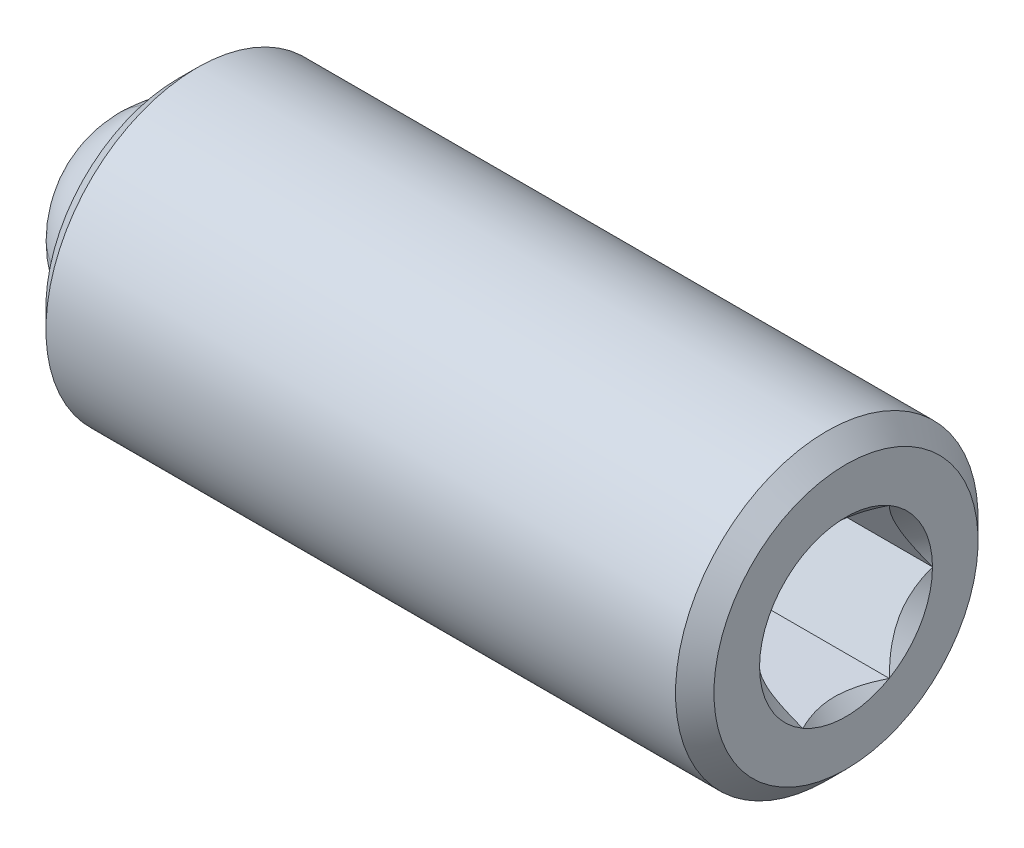
ISO-10303-21;
HEADER;
FILE_DESCRIPTION(('STEP AP214'),'2;1');
FILE_NAME('part.step','',(''),(''),'','','');
FILE_SCHEMA(('AUTOMOTIVE_DESIGN { 1 0 10303 214 1 1 1 1 }'));
ENDSEC;
DATA;
#1=APPLICATION_CONTEXT('core data for automotive mechanical design processes');
#2=APPLICATION_PROTOCOL_DEFINITION('international standard','automotive_design',2000,#1);
#3=PRODUCT_CONTEXT('',#1,'mechanical');
#4=PRODUCT('Part','Part','',(#3));
#5=PRODUCT_RELATED_PRODUCT_CATEGORY('part','',(#4));
#6=PRODUCT_DEFINITION_FORMATION('','',#4);
#7=PRODUCT_DEFINITION_CONTEXT('part definition',#1,'design');
#8=PRODUCT_DEFINITION('design','',#6,#7);
#9=PRODUCT_DEFINITION_SHAPE('','',#8);
#10=(LENGTH_UNIT() NAMED_UNIT(*) SI_UNIT(.MILLI.,.METRE.));
#11=(NAMED_UNIT(*) PLANE_ANGLE_UNIT() SI_UNIT($,.RADIAN.));
#12=(NAMED_UNIT(*) SI_UNIT($,.STERADIAN.) SOLID_ANGLE_UNIT());
#13=UNCERTAINTY_MEASURE_WITH_UNIT(LENGTH_MEASURE(1.E-05),#10,'distance_accuracy_value','');
#14=(GEOMETRIC_REPRESENTATION_CONTEXT(3) GLOBAL_UNCERTAINTY_ASSIGNED_CONTEXT((#13)) GLOBAL_UNIT_ASSIGNED_CONTEXT((#10,
#11,#12)) REPRESENTATION_CONTEXT('',''));
#15=CARTESIAN_POINT('',(0.,0.,0.));
#16=DIRECTION('',(0.,0.,1.));
#17=DIRECTION('',(1.,0.,0.));
#18=AXIS2_PLACEMENT_3D('',#15,#16,#17);
#19=CARTESIAN_POINT('',(-49.5388925463941,7.80634505997568,21.5292838880146));
#20=DIRECTION('',(1.,0.,0.));
#21=DIRECTION('',(0.,0.,-1.));
#22=AXIS2_PLACEMENT_3D('',#19,#20,#21);
#23=PLANE('',#22);
#24=CARTESIAN_POINT('',(-49.5388925463941,7.80634505997568,21.5292838880146));
#25=DIRECTION('',(1.,0.,0.));
#26=DIRECTION('',(0.,0.,-1.));
#27=AXIS2_PLACEMENT_3D('',#24,#25,#26);
#28=CIRCLE('',#27,0.99694999999999);
#29=CARTESIAN_POINT('',(-49.5388925463941,8.39893692435799,20.7275706071168));
#30=VERTEX_POINT('',#29);
#31=CARTESIAN_POINT('',(-49.5388925463941,8.79694505997568,21.4169409198324));
#32=VERTEX_POINT('',#31);
#33=EDGE_CURVE('P0_E11',#30,#32,#28,.T.);
#34=ORIENTED_EDGE('',*,*,#33,.F.);
#35=DIRECTION('',(0.,0.866025403784439,0.5));
#36=VECTOR('',#35,1.);
#37=CARTESIAN_POINT('',(-49.5388925463941,7.80634505997568,20.3854375346961));
#38=LINE('',#37,#36);
#39=CARTESIAN_POINT('',(-49.5388925463941,8.79694505997568,20.9573607113553));
#40=VERTEX_POINT('',#39);
#41=EDGE_CURVE('P0_E247',#30,#40,#38,.T.);
#42=ORIENTED_EDGE('',*,*,#41,.T.);
#43=DIRECTION('',(0.,0.,1.));
#44=VECTOR('',#43,1.);
#45=CARTESIAN_POINT('',(-49.5388925463941,8.79694505997568,20.9573607113553));
#46=LINE('',#45,#44);
#47=EDGE_CURVE('P0_E254',#40,#32,#46,.T.);
#48=ORIENTED_EDGE('',*,*,#47,.T.);
#49=EDGE_LOOP('',(#34,#42,#48));
#50=FACE_BOUND('',#49,.T.);
#51=ADVANCED_FACE('P0_F17',(#50),#23,.T.);
#52=CARTESIAN_POINT('',(-49.5388925463941,8.79694505997568,21.6416268561967));
#53=VERTEX_POINT('',#52);
#54=CARTESIAN_POINT('',(-49.5388925463941,8.39893692435799,22.3309971689123));
#55=VERTEX_POINT('',#54);
#56=EDGE_CURVE('P0_E32',#53,#55,#28,.T.);
#57=ORIENTED_EDGE('',*,*,#56,.F.);
#58=CARTESIAN_POINT('',(-49.5388925463941,8.79694505997568,22.1012070646738));
#59=VERTEX_POINT('',#58);
#60=EDGE_CURVE('P0_E252',#53,#59,#46,.T.);
#61=ORIENTED_EDGE('',*,*,#60,.T.);
#62=DIRECTION('',(0.,-0.866025403784439,0.5));
#63=VECTOR('',#62,1.);
#64=CARTESIAN_POINT('',(-49.5388925463941,8.79694505997568,22.1012070646738));
#65=LINE('',#64,#63);
#66=EDGE_CURVE('P0_E228',#59,#55,#65,.T.);
#67=ORIENTED_EDGE('',*,*,#66,.T.);
#68=EDGE_LOOP('',(#57,#61,#67));
#69=FACE_BOUND('',#68,.T.);
#70=ADVANCED_FACE('P0_F346',(#69),#23,.T.);
#71=CARTESIAN_POINT('',(-49.5388925463941,8.20435319559337,22.4433401370945));
#72=VERTEX_POINT('',#71);
#73=CARTESIAN_POINT('',(-49.5388925463941,7.40833692435797,22.4433401370945));
#74=VERTEX_POINT('',#73);
#75=EDGE_CURVE('P0_E327',#72,#74,#28,.T.);
#76=ORIENTED_EDGE('',*,*,#75,.F.);
#77=CARTESIAN_POINT('',(-49.5388925463941,7.80634505997568,22.673130241333));
#78=VERTEX_POINT('',#77);
#79=EDGE_CURVE('P0_E233',#72,#78,#65,.T.);
#80=ORIENTED_EDGE('',*,*,#79,.T.);
#81=DIRECTION('',(0.,-0.866025403784439,-0.5));
#82=VECTOR('',#81,1.);
#83=CARTESIAN_POINT('',(-49.5388925463941,7.80634505997568,22.673130241333));
#84=LINE('',#83,#82);
#85=EDGE_CURVE('P0_E234',#78,#74,#84,.T.);
#86=ORIENTED_EDGE('',*,*,#85,.T.);
#87=EDGE_LOOP('',(#76,#80,#86));
#88=FACE_BOUND('',#87,.T.);
#89=ADVANCED_FACE('P0_F393',(#88),#23,.T.);
#90=CARTESIAN_POINT('',(-49.5388925463941,7.21375319559338,22.3309971689123));
#91=VERTEX_POINT('',#90);
#92=CARTESIAN_POINT('',(-49.5388925463941,6.81574505997568,21.6416268561967));
#93=VERTEX_POINT('',#92);
#94=EDGE_CURVE('P0_E322',#91,#93,#28,.T.);
#95=ORIENTED_EDGE('',*,*,#94,.F.);
#96=CARTESIAN_POINT('',(-49.5388925463941,6.81574505997568,22.1012070646738));
#97=VERTEX_POINT('',#96);
#98=EDGE_CURVE('P0_E231',#91,#97,#84,.T.);
#99=ORIENTED_EDGE('',*,*,#98,.T.);
#100=DIRECTION('',(0.,0.,-1.));
#101=VECTOR('',#100,1.);
#102=CARTESIAN_POINT('',(-49.5388925463941,6.81574505997568,22.1012070646738));
#103=LINE('',#102,#101);
#104=EDGE_CURVE('P0_E239',#97,#93,#103,.T.);
#105=ORIENTED_EDGE('',*,*,#104,.T.);
#106=EDGE_LOOP('',(#95,#99,#105));
#107=FACE_BOUND('',#106,.T.);
#108=ADVANCED_FACE('P0_F404',(#107),#23,.T.);
#109=CARTESIAN_POINT('',(-49.5388925463941,6.81574505997568,21.4169409198324));
#110=VERTEX_POINT('',#109);
#111=CARTESIAN_POINT('',(-49.5388925463941,7.21375319559338,20.7275706071168));
#112=VERTEX_POINT('',#111);
#113=EDGE_CURVE('P0_E319',#110,#112,#28,.T.);
#114=ORIENTED_EDGE('',*,*,#113,.F.);
#115=CARTESIAN_POINT('',(-49.5388925463941,6.81574505997568,20.9573607113553));
#116=VERTEX_POINT('',#115);
#117=EDGE_CURVE('P0_E237',#110,#116,#103,.T.);
#118=ORIENTED_EDGE('',*,*,#117,.T.);
#119=DIRECTION('',(0.,0.866025403784439,-0.5));
#120=VECTOR('',#119,1.);
#121=CARTESIAN_POINT('',(-49.5388925463941,6.81574505997568,20.9573607113553));
#122=LINE('',#121,#120);
#123=EDGE_CURVE('P0_E244',#116,#112,#122,.T.);
#124=ORIENTED_EDGE('',*,*,#123,.T.);
#125=EDGE_LOOP('',(#114,#118,#124));
#126=FACE_BOUND('',#125,.T.);
#127=ADVANCED_FACE('P0_F397',(#126),#23,.T.);
#128=CARTESIAN_POINT('',(-55.3224925463941,9.20334505997568,21.5292838880146));
#129=DIRECTION('',(1.,0.,0.));
#130=DIRECTION('',(0.,1.,0.));
#131=AXIS2_PLACEMENT_3D('',#128,#129,#130);
#132=PLANE('',#131);
#133=CARTESIAN_POINT('',(-55.3224925463941,7.80634505997569,21.5292838880146));
#134=DIRECTION('',(1.,0.,0.));
#135=DIRECTION('',(0.,1.,0.));
#136=AXIS2_PLACEMENT_3D('',#133,#134,#135);
#137=CIRCLE('',#136,1.74599999999999);
#138=CARTESIAN_POINT('',(-55.3224925463941,9.55234505997567,21.5292838880146));
#139=VERTEX_POINT('',#138);
#140=EDGE_CURVE('P0_E313',#139,#139,#137,.F.);
#141=ORIENTED_EDGE('',*,*,#140,.T.);
#142=EDGE_LOOP('',(#141));
#143=FACE_BOUND('',#142,.T.);
#144=CARTESIAN_POINT('',(-55.3224925463941,7.80634505997569,21.5292838880146));
#145=DIRECTION('',(-1.,0.,0.));
#146=DIRECTION('',(0.,-1.,0.));
#147=AXIS2_PLACEMENT_3D('',#144,#145,#146);
#148=CIRCLE('',#147,1.39699999999999);
#149=CARTESIAN_POINT('',(-55.3224925463941,6.40934505997569,21.5292838880146));
#150=VERTEX_POINT('',#149);
#151=EDGE_CURVE('P0_E302',#150,#150,#148,.T.);
#152=ORIENTED_EDGE('',*,*,#151,.F.);
#153=EDGE_LOOP('',(#152));
#154=FACE_BOUND('',#153,.T.);
#155=ADVANCED_FACE('P0_F403',(#143,#154),#132,.F.);
#156=CARTESIAN_POINT('',(-53.1373990199102,7.80634505997569,21.5292838880146));
#157=DIRECTION('',(-1.,0.,0.));
#158=DIRECTION('',(0.,-1.,0.));
#159=AXIS2_PLACEMENT_3D('',#156,#157,#158);
#160=CYLINDRICAL_SURFACE('',#159,1.39699999999999);
#161=CARTESIAN_POINT('',(-54.5343990199102,7.80634505997569,21.5292838880146));
#162=DIRECTION('',(-1.,0.,0.));
#163=DIRECTION('',(0.,-1.,0.));
#164=AXIS2_PLACEMENT_3D('',#161,#162,#163);
#165=CIRCLE('',#164,1.39699999999999);
#166=CARTESIAN_POINT('',(-54.5343990199102,6.40934505997569,21.5292838880146));
#167=VERTEX_POINT('',#166);
#168=EDGE_CURVE('P0_E285',#167,#167,#165,.T.);
#169=ORIENTED_EDGE('',*,*,#168,.F.);
#170=EDGE_LOOP('',(#169));
#171=FACE_BOUND('',#170,.T.);
#172=ORIENTED_EDGE('',*,*,#151,.T.);
#173=EDGE_LOOP('',(#172));
#174=FACE_BOUND('',#173,.T.);
#175=ADVANCED_FACE('P0_F410',(#171,#174),#160,.F.);
#176=CARTESIAN_POINT('',(-54.5343990199102,7.80634505997569,21.5292838880146));
#177=DIRECTION('',(-1.,0.,0.));
#178=DIRECTION('',(0.,-1.,0.));
#179=AXIS2_PLACEMENT_3D('',#176,#177,#178);
#180=CONICAL_SURFACE('',#179,1.39699999999999,0.785398163397448);
#181=CARTESIAN_POINT('',(-53.1373990199102,7.80634505997569,21.5292838880146));
#182=VERTEX_POINT('',#181);
#183=VERTEX_LOOP('',#182);
#184=FACE_BOUND('',#183,.T.);
#185=ORIENTED_EDGE('',*,*,#168,.T.);
#186=EDGE_LOOP('',(#185));
#187=FACE_BOUND('',#186,.T.);
#188=ADVANCED_FACE('P0_F601',(#184,#187),#180,.F.);
#189=CARTESIAN_POINT('',(-46.4908925463941,7.80634505997568,21.5292838880146));
#190=DIRECTION('',(-1.,0.,0.));
#191=DIRECTION('',(0.,-1.,0.));
#192=AXIS2_PLACEMENT_3D('',#189,#190,#191);
#193=PLANE('',#192);
#194=DIRECTION('',(0.,-0.866025403784439,-0.5));
#195=VECTOR('',#194,1.);
#196=CARTESIAN_POINT('',(-46.4908925463941,7.80634505997568,22.673130241333));
#197=LINE('',#196,#195);
#198=CARTESIAN_POINT('',(-46.4908925463941,6.817212618757,22.1020543601313));
#199=VERTEX_POINT('',#198);
#200=CARTESIAN_POINT('',(-46.4908925463941,6.81574505997568,22.1012070646738));
#201=VERTEX_POINT('',#200);
#202=EDGE_CURVE('P0_E262',#199,#201,#197,.T.);
#203=ORIENTED_EDGE('',*,*,#202,.F.);
#204=CARTESIAN_POINT('',(-46.4908925463941,7.80634505997568,21.5292838880146));
#205=DIRECTION('',(1.,0.,0.));
#206=DIRECTION('',(0.,1.,0.));
#207=AXIS2_PLACEMENT_3D('',#204,#205,#206);
#208=CIRCLE('',#207,1.143);
#209=CARTESIAN_POINT('',(-46.4908925463941,7.80487750119436,22.6722829458756));
#210=VERTEX_POINT('',#209);
#211=EDGE_CURVE('P0_E359',#210,#199,#208,.T.);
#212=ORIENTED_EDGE('',*,*,#211,.F.);
#213=CARTESIAN_POINT('',(-46.4908925463941,7.80634505997568,22.673130241333));
#214=VERTEX_POINT('',#213);
#215=EDGE_CURVE('P0_E263',#214,#210,#197,.T.);
#216=ORIENTED_EDGE('',*,*,#215,.F.);
#217=DIRECTION('',(0.,-0.866025403784439,0.5));
#218=VECTOR('',#217,1.);
#219=CARTESIAN_POINT('',(-46.4908925463941,8.79694505997568,22.1012070646738));
#220=LINE('',#219,#218);
#221=CARTESIAN_POINT('',(-46.4908925463941,7.80781098692445,22.6722838880146));
#222=VERTEX_POINT('',#221);
#223=EDGE_CURVE('P0_E221',#222,#214,#220,.T.);
#224=ORIENTED_EDGE('',*,*,#223,.F.);
#225=CARTESIAN_POINT('',(-46.4908925463941,8.79547750119436,22.1020543601313));
#226=VERTEX_POINT('',#225);
#227=EDGE_CURVE('P0_E48',#226,#222,#208,.T.);
#228=ORIENTED_EDGE('',*,*,#227,.F.);
#229=CARTESIAN_POINT('',(-46.4908925463941,8.79694505997568,22.1012070646738));
#230=VERTEX_POINT('',#229);
#231=EDGE_CURVE('P0_E259',#230,#226,#220,.T.);
#232=ORIENTED_EDGE('',*,*,#231,.F.);
#233=DIRECTION('',(0.,0.,1.));
#234=VECTOR('',#233,1.);
#235=CARTESIAN_POINT('',(-46.4908925463941,8.79694505997568,20.9573607113553));
#236=LINE('',#235,#234);
#237=CARTESIAN_POINT('',(-46.4908925463941,8.79694505997568,22.0995124737589));
#238=VERTEX_POINT('',#237);
#239=EDGE_CURVE('P0_E278',#238,#230,#236,.T.);
#240=ORIENTED_EDGE('',*,*,#239,.F.);
#241=CARTESIAN_POINT('',(-46.4908925463941,8.79694505997568,20.9590553022702));
#242=VERTEX_POINT('',#241);
#243=EDGE_CURVE('P0_E165',#242,#238,#208,.T.);
#244=ORIENTED_EDGE('',*,*,#243,.F.);
#245=CARTESIAN_POINT('',(-46.4908925463941,8.79694505997568,20.9573607113553));
#246=VERTEX_POINT('',#245);
#247=EDGE_CURVE('P0_E279',#246,#242,#236,.T.);
#248=ORIENTED_EDGE('',*,*,#247,.F.);
#249=DIRECTION('',(0.,0.866025403784439,0.5));
#250=VECTOR('',#249,1.);
#251=CARTESIAN_POINT('',(-46.4908925463941,7.80634505997568,20.3854375346961));
#252=LINE('',#251,#250);
#253=CARTESIAN_POINT('',(-46.4908925463941,8.79547750119436,20.9565134158979));
#254=VERTEX_POINT('',#253);
#255=EDGE_CURVE('P0_E274',#254,#246,#252,.T.);
#256=ORIENTED_EDGE('',*,*,#255,.F.);
#257=CARTESIAN_POINT('',(-46.4908925463941,7.807812618757,20.3862848301535));
#258=VERTEX_POINT('',#257);
#259=EDGE_CURVE('P0_E168',#258,#254,#208,.T.);
#260=ORIENTED_EDGE('',*,*,#259,.F.);
#261=CARTESIAN_POINT('',(-46.4908925463941,7.80634505997568,20.3854375346961));
#262=VERTEX_POINT('',#261);
#263=EDGE_CURVE('P0_E275',#262,#258,#252,.T.);
#264=ORIENTED_EDGE('',*,*,#263,.F.);
#265=DIRECTION('',(0.,0.866025403784439,-0.5));
#266=VECTOR('',#265,1.);
#267=CARTESIAN_POINT('',(-46.4908925463941,6.81574505997568,20.9573607113553));
#268=LINE('',#267,#266);
#269=CARTESIAN_POINT('',(-46.4908925463941,7.8048791330269,20.3862838880146));
#270=VERTEX_POINT('',#269);
#271=EDGE_CURVE('P0_E270',#270,#262,#268,.T.);
#272=ORIENTED_EDGE('',*,*,#271,.F.);
#273=CARTESIAN_POINT('',(-46.4908925463941,6.817212618757,20.9565134158979));
#274=VERTEX_POINT('',#273);
#275=EDGE_CURVE('P0_E363',#274,#270,#208,.T.);
#276=ORIENTED_EDGE('',*,*,#275,.F.);
#277=CARTESIAN_POINT('',(-46.4908925463941,6.81574505997568,20.9573607113553));
#278=VERTEX_POINT('',#277);
#279=EDGE_CURVE('P0_E271',#278,#274,#268,.T.);
#280=ORIENTED_EDGE('',*,*,#279,.F.);
#281=DIRECTION('',(0.,0.,-1.));
#282=VECTOR('',#281,1.);
#283=CARTESIAN_POINT('',(-46.4908925463941,6.81574505997568,22.1012070646738));
#284=LINE('',#283,#282);
#285=CARTESIAN_POINT('',(-46.4908925463941,6.81574505997568,20.9590553022702));
#286=VERTEX_POINT('',#285);
#287=EDGE_CURVE('P0_E266',#286,#278,#284,.T.);
#288=ORIENTED_EDGE('',*,*,#287,.F.);
#289=CARTESIAN_POINT('',(-46.4908925463941,6.81574505997568,22.0995124737589));
#290=VERTEX_POINT('',#289);
#291=EDGE_CURVE('P0_E360',#290,#286,#208,.T.);
#292=ORIENTED_EDGE('',*,*,#291,.F.);
#293=EDGE_CURVE('P0_E267',#201,#290,#284,.T.);
#294=ORIENTED_EDGE('',*,*,#293,.F.);
#295=EDGE_LOOP('',(#203,#212,#216,#224,#228,#232,#240,#244,#248,#256,#260,#264,#272,#276,#280,
#288,#292,#294));
#296=FACE_BOUND('',#295,.T.);
#297=CARTESIAN_POINT('',(-46.4908925463941,7.80634505997568,21.5292838880146));
#298=DIRECTION('',(-1.,0.,0.));
#299=DIRECTION('',(0.,-1.,0.));
#300=AXIS2_PLACEMENT_3D('',#297,#298,#299);
#301=CIRCLE('',#300,1.746);
#302=CARTESIAN_POINT('',(-46.4908925463941,6.06034505997568,21.5292838880146));
#303=VERTEX_POINT('',#302);
#304=EDGE_CURVE('P0_E311',#303,#303,#301,.F.);
#305=ORIENTED_EDGE('',*,*,#304,.T.);
#306=EDGE_LOOP('',(#305));
#307=FACE_BOUND('',#306,.T.);
#308=ADVANCED_FACE('P0_F354',(#296,#307),#193,.F.);
#309=CARTESIAN_POINT('',(-53.1373990199102,7.80634505997569,21.5292838880146));
#310=DIRECTION('',(-1.,0.,0.));
#311=DIRECTION('',(0.,-1.,0.));
#312=AXIS2_PLACEMENT_3D('',#309,#310,#311);
#313=CYLINDRICAL_SURFACE('',#312,2.);
#314=CARTESIAN_POINT('',(-46.7448925463941,7.80634505997568,21.5292838880146));
#315=DIRECTION('',(-1.,0.,0.));
#316=DIRECTION('',(0.,-1.,0.));
#317=AXIS2_PLACEMENT_3D('',#314,#315,#316);
#318=CIRCLE('',#317,2.);
#319=CARTESIAN_POINT('',(-46.7448925463941,5.80634505997568,21.5292838880146));
#320=VERTEX_POINT('',#319);
#321=EDGE_CURVE('P0_E308',#320,#320,#318,.T.);
#322=ORIENTED_EDGE('',*,*,#321,.T.);
#323=EDGE_LOOP('',(#322));
#324=FACE_BOUND('',#323,.T.);
#325=CARTESIAN_POINT('',(-55.0684925463941,7.80634505997569,21.5292838880146));
#326=DIRECTION('',(1.,0.,0.));
#327=DIRECTION('',(0.,1.,0.));
#328=AXIS2_PLACEMENT_3D('',#325,#326,#327);
#329=CIRCLE('',#328,2.);
#330=CARTESIAN_POINT('',(-55.0684925463941,9.80634505997568,21.5292838880146));
#331=VERTEX_POINT('',#330);
#332=EDGE_CURVE('P0_E305',#331,#331,#329,.T.);
#333=ORIENTED_EDGE('',*,*,#332,.T.);
#334=EDGE_LOOP('',(#333));
#335=FACE_BOUND('',#334,.T.);
#336=ADVANCED_FACE('P0_F211',(#324,#335),#313,.T.);
#337=CARTESIAN_POINT('',(-46.7448925463941,7.80634505997568,21.5292838880146));
#338=DIRECTION('',(-1.,0.,0.));
#339=DIRECTION('',(0.,-1.,0.));
#340=AXIS2_PLACEMENT_3D('',#337,#338,#339);
#341=CONICAL_SURFACE('',#340,2.,0.785398163397446);
#342=ORIENTED_EDGE('',*,*,#304,.F.);
#343=EDGE_LOOP('',(#342));
#344=FACE_BOUND('',#343,.T.);
#345=ORIENTED_EDGE('',*,*,#321,.F.);
#346=EDGE_LOOP('',(#345));
#347=FACE_BOUND('',#346,.T.);
#348=ADVANCED_FACE('P0_F574',(#344,#347),#341,.T.);
#349=CARTESIAN_POINT('',(-55.3224925463941,7.80634505997569,21.5292838880146));
#350=DIRECTION('',(1.,0.,0.));
#351=DIRECTION('',(0.,1.,0.));
#352=AXIS2_PLACEMENT_3D('',#349,#350,#351);
#353=CONICAL_SURFACE('',#352,1.74599999999999,0.785398163397448);
#354=ORIENTED_EDGE('',*,*,#332,.F.);
#355=EDGE_LOOP('',(#354));
#356=FACE_BOUND('',#355,.T.);
#357=ORIENTED_EDGE('',*,*,#140,.F.);
#358=EDGE_LOOP('',(#357));
#359=FACE_BOUND('',#358,.T.);
#360=ADVANCED_FACE('P0_F19',(#356,#359),#353,.T.);
#361=CARTESIAN_POINT('',(-49.5388925463941,8.79694505997568,22.1012070646738));
#362=DIRECTION('',(0.,0.5,0.866025403784439));
#363=DIRECTION('',(0.,-0.866025403784439,0.5));
#364=AXIS2_PLACEMENT_3D('',#361,#362,#363);
#365=PLANE('',#364);
#366=ORIENTED_EDGE('',*,*,#231,.T.);
#367=CARTESIAN_POINT('',(-46.4906925463939,8.7958245921301,22.1018539670861));
#368=CARTESIAN_POINT('',(-46.5102590050146,8.76184453992799,22.121472359372));
#369=CARTESIAN_POINT('',(-46.5286731602873,8.72729709355357,22.1414183368361));
#370=CARTESIAN_POINT('',(-46.5623832654716,8.65685525137214,22.1820879533818));
#371=CARTESIAN_POINT('',(-46.5776605586903,8.62095421917391,22.2028154239856));
#372=CARTESIAN_POINT('',(-46.6038273998988,8.54856214433129,22.2446110078832));
#373=CARTESIAN_POINT('',(-46.6147824300038,8.51208937274734,22.2656685723753));
#374=CARTESIAN_POINT('',(-46.6316585069572,8.43834495297953,22.3082449329795));
#375=CARTESIAN_POINT('',(-46.6375920692112,8.40107552972844,22.329762444526));
#376=CARTESIAN_POINT('',(-46.6429459349502,8.33678082232183,22.3668830111547));
#377=CARTESIAN_POINT('',(-46.6437333550918,8.30983814983403,22.3824383703682));
#378=CARTESIAN_POINT('',(-46.6423799493829,8.25600563015096,22.4135185900984));
#379=CARTESIAN_POINT('',(-46.6402384721228,8.22911579603952,22.4290434430611));
#380=CARTESIAN_POINT('',(-46.6295625381593,8.14883163348696,22.4753955259225));
#381=CARTESIAN_POINT('',(-46.6167754251208,8.09583758028656,22.5059916568032));
#382=CARTESIAN_POINT('',(-46.5860142537032,8.00308848437012,22.5595403722976));
#383=CARTESIAN_POINT('',(-46.5696903140842,7.9628876840985,22.5827503151561));
#384=CARTESIAN_POINT('',(-46.5329370572282,7.88405195284486,22.6282661458171));
#385=CARTESIAN_POINT('',(-46.5125211395954,7.8454123931566,22.6505747060045));
#386=CARTESIAN_POINT('',(-46.4906925463941,7.80746552782162,22.6724833389206));
#387=B_SPLINE_CURVE_WITH_KNOTS('',3,(#367,#368,#369,#370,#371,#372,#373,#374,#375,#376,#377,
#378,#379,#380,#381,#382,#383,#384,#385,#386),.UNSPECIFIED.,.F.,.F.,(4,2,2,2,2,2,2,2,2,4),(0.,
0.131625127619597,0.264011770716204,0.394307736662356,0.524277991049731,0.617504646941289,
0.71075204054236,0.897297861024571,1.04472299547961,1.19167303462289),.UNSPECIFIED.);
#388=EDGE_CURVE('P0_E214',#226,#222,#387,.T.);
#389=ORIENTED_EDGE('',*,*,#388,.T.);
#390=ORIENTED_EDGE('',*,*,#223,.T.);
#391=DIRECTION('',(1.,0.,0.));
#392=VECTOR('',#391,1.);
#393=CARTESIAN_POINT('',(-49.5388925463941,7.80634505997568,22.673130241333));
#394=LINE('',#393,#392);
#395=EDGE_CURVE('P0_E257',#78,#214,#394,.T.);
#396=ORIENTED_EDGE('',*,*,#395,.F.);
#397=ORIENTED_EDGE('',*,*,#79,.F.);
#398=EDGE_CURVE('P0_E232',#55,#72,#65,.T.);
#399=ORIENTED_EDGE('',*,*,#398,.F.);
#400=ORIENTED_EDGE('',*,*,#66,.F.);
#401=DIRECTION('',(1.,0.,0.));
#402=VECTOR('',#401,1.);
#403=CARTESIAN_POINT('',(-49.5388925463941,8.79694505997568,22.1012070646738));
#404=LINE('',#403,#402);
#405=EDGE_CURVE('P0_E282',#59,#230,#404,.T.);
#406=ORIENTED_EDGE('',*,*,#405,.T.);
#407=EDGE_LOOP('',(#366,#389,#390,#396,#397,#399,#400,#406));
#408=FACE_BOUND('',#407,.T.);
#409=ADVANCED_FACE('P0_F205',(#408),#365,.F.);
#410=CARTESIAN_POINT('',(-49.5388925463941,8.79694505997568,20.9573607113553));
#411=DIRECTION('',(0.,1.,0.));
#412=DIRECTION('',(0.,0.,1.));
#413=AXIS2_PLACEMENT_3D('',#410,#411,#412);
#414=PLANE('',#413);
#415=ORIENTED_EDGE('',*,*,#247,.T.);
#416=CARTESIAN_POINT('',(-46.1235823296184,8.79694505997568,20.3892187184312));
#417=CARTESIAN_POINT('',(-46.1445357886817,8.79694505997568,20.4169812050963));
#418=CARTESIAN_POINT('',(-46.1652836255819,8.79694505997568,20.4448984469341));
#419=CARTESIAN_POINT('',(-46.2062831353135,8.79694505997568,20.5011052028504));
#420=CARTESIAN_POINT('',(-46.2265346830941,8.79694505997568,20.5293948080489));
#421=CARTESIAN_POINT('',(-46.2867064860434,8.79694505997568,20.6153305043684));
#422=CARTESIAN_POINT('',(-46.3257211713851,8.79694505997568,20.6736213639959));
#423=CARTESIAN_POINT('',(-46.4023063203306,8.79694505997568,20.7958512666058));
#424=CARTESIAN_POINT('',(-46.439667643137,8.79694505997568,20.8599228586336));
#425=CARTESIAN_POINT('',(-46.5080057402334,8.79694505997568,20.9912655384185));
#426=CARTESIAN_POINT('',(-46.5390040370871,8.79694505997568,21.0585248606222));
#427=CARTESIAN_POINT('',(-46.5769274034828,8.79694505997568,21.1594872862629));
#428=CARTESIAN_POINT('',(-46.5878126567894,8.79694505997568,21.1916968672462));
#429=CARTESIAN_POINT('',(-46.6069971972716,8.79694505997568,21.2568931213354));
#430=CARTESIAN_POINT('',(-46.6152963061343,8.79694505997568,21.2898798478564));
#431=CARTESIAN_POINT('',(-46.6287383524986,8.79694505997568,21.3558770985005));
#432=CARTESIAN_POINT('',(-46.6339357861337,8.79694505997568,21.3888763474111));
#433=CARTESIAN_POINT('',(-46.6410764234897,8.79694505997568,21.4552378820543));
#434=CARTESIAN_POINT('',(-46.6430191295743,8.79694505997568,21.4886002225175));
#435=CARTESIAN_POINT('',(-46.6435031289214,8.79694505997568,21.5541434185273));
#436=CARTESIAN_POINT('',(-46.6421647360608,8.79694505997568,21.5863234269759));
#437=CARTESIAN_POINT('',(-46.6364266161165,8.79694505997568,21.650396804902));
#438=CARTESIAN_POINT('',(-46.6320275924625,8.79694505997568,21.6822902385379));
#439=CARTESIAN_POINT('',(-46.6203336681522,8.79694505997568,21.7461155097927));
#440=CARTESIAN_POINT('',(-46.612989051085,8.79694505997568,21.7780380998047));
#441=CARTESIAN_POINT('',(-46.595794150066,8.79694505997568,21.8411858546559));
#442=CARTESIAN_POINT('',(-46.5859440764946,8.79694505997568,21.8724110778128));
#443=CARTESIAN_POINT('',(-46.5512190503309,8.79694505997568,21.9707469163157));
#444=CARTESIAN_POINT('',(-46.5223882166657,8.79694505997568,22.0364571965356));
#445=CARTESIAN_POINT('',(-46.4582871381036,8.79694505997568,22.1647905917929));
#446=CARTESIAN_POINT('',(-46.4229937529597,8.79694505997568,22.2274015515155));
#447=CARTESIAN_POINT('',(-46.3501812204873,8.79694505997568,22.3470597187596));
#448=CARTESIAN_POINT('',(-46.3128598640196,8.79694505997568,22.4042287909065));
#449=CARTESIAN_POINT('',(-46.2551652602994,8.79694505997568,22.4884559262912));
#450=CARTESIAN_POINT('',(-46.2357303647779,8.79694505997568,22.5161681094821));
#451=CARTESIAN_POINT('',(-46.19634665217,8.79694505997568,22.5712138159907));
#452=CARTESIAN_POINT('',(-46.1763979770725,8.79694505997568,22.5985474407836));
#453=CARTESIAN_POINT('',(-46.1562362734382,8.79694505997568,22.6257234444908));
#454=B_SPLINE_CURVE_WITH_KNOTS('',3,(#416,#417,#418,#419,#420,#421,#422,#423,#424,#425,#426,
#427,#428,#429,#430,#431,#432,#433,#434,#435,#436,#437,#438,#439,#440,#441,#442,#443,#444,#445,
#446,#447,#448,#449,#450,#451,#452,#453),.UNSPECIFIED.,.F.,.F.,(4,2,2,2,2,2,2,2,2,2,2,2,2,2,2,2,
2,2,4),(0.,0.104344019556665,0.208714065995305,0.41904723860194,0.641371595426503,
0.862931089855696,0.964842435960924,1.06676080722523,1.16683130424735,1.26691710029625,
1.363388122542,1.45983698002154,1.55798726512869,1.65612931138883,1.87076833826789,
2.08619150382141,2.29090841446406,2.39244822901592,2.49396027677513),.UNSPECIFIED.);
#455=EDGE_CURVE('P0_E222',#242,#238,#454,.T.);
#456=ORIENTED_EDGE('',*,*,#455,.T.);
#457=ORIENTED_EDGE('',*,*,#239,.T.);
#458=ORIENTED_EDGE('',*,*,#405,.F.);
#459=ORIENTED_EDGE('',*,*,#60,.F.);
#460=EDGE_CURVE('P0_E258',#32,#53,#46,.T.);
#461=ORIENTED_EDGE('',*,*,#460,.F.);
#462=ORIENTED_EDGE('',*,*,#47,.F.);
#463=DIRECTION('',(1.,0.,0.));
#464=VECTOR('',#463,1.);
#465=CARTESIAN_POINT('',(-49.5388925463941,8.79694505997568,20.9573607113553));
#466=LINE('',#465,#464);
#467=EDGE_CURVE('P0_E286',#40,#246,#466,.T.);
#468=ORIENTED_EDGE('',*,*,#467,.T.);
#469=EDGE_LOOP('',(#415,#456,#457,#458,#459,#461,#462,#468));
#470=FACE_BOUND('',#469,.T.);
#471=ADVANCED_FACE('P0_F209',(#470),#414,.F.);
#472=CARTESIAN_POINT('',(-49.5388925463941,7.80634505997568,20.3854375346961));
#473=DIRECTION('',(0.,0.5,-0.866025403784439));
#474=DIRECTION('',(0.,0.866025403784439,0.5));
#475=AXIS2_PLACEMENT_3D('',#472,#473,#474);
#476=PLANE('',#475);
#477=ORIENTED_EDGE('',*,*,#263,.T.);
#478=CARTESIAN_POINT('',(-46.4906925463941,7.80746552782162,20.3860844371086));
#479=CARTESIAN_POINT('',(-46.5102590050148,7.84144558002371,20.4057028293945));
#480=CARTESIAN_POINT('',(-46.5286731602875,7.87599302639811,20.4256488068586));
#481=CARTESIAN_POINT('',(-46.5623832654717,7.94643486857949,20.4663184234042));
#482=CARTESIAN_POINT('',(-46.5776605586904,7.9823359007777,20.487045894008));
#483=CARTESIAN_POINT('',(-46.6038273998989,8.05472797562027,20.5288414779056));
#484=CARTESIAN_POINT('',(-46.6147824300039,8.09120074720419,20.5498990423977));
#485=CARTESIAN_POINT('',(-46.6316585069572,8.16494516697195,20.5924754030018));
#486=CARTESIAN_POINT('',(-46.6375920692112,8.20221459022301,20.6139929145483));
#487=CARTESIAN_POINT('',(-46.6429459349502,8.26650929762959,20.651113481177));
#488=CARTESIAN_POINT('',(-46.6437333550918,8.29345197011739,20.6666688403905));
#489=CARTESIAN_POINT('',(-46.6423799493829,8.34728448980046,20.6977490601207));
#490=CARTESIAN_POINT('',(-46.6402384721228,8.3741743239119,20.7132739130834));
#491=CARTESIAN_POINT('',(-46.6295625381593,8.45445848646445,20.7596259959448));
#492=CARTESIAN_POINT('',(-46.6167754251208,8.50745253966484,20.7902221268255));
#493=CARTESIAN_POINT('',(-46.5860142537031,8.60020163558135,20.84377084232));
#494=CARTESIAN_POINT('',(-46.5696903140841,8.64040243585302,20.8669807851785));
#495=CARTESIAN_POINT('',(-46.5329370572281,8.71923816710677,20.9124966158396));
#496=CARTESIAN_POINT('',(-46.5125211395952,8.75787772679508,20.934805176027));
#497=CARTESIAN_POINT('',(-46.4906925463939,8.7958245921301,20.9567138089431));
#498=B_SPLINE_CURVE_WITH_KNOTS('',3,(#478,#479,#480,#481,#482,#483,#484,#485,#486,#487,#488,
#489,#490,#491,#492,#493,#494,#495,#496,#497),.UNSPECIFIED.,.F.,.F.,(4,2,2,2,2,2,2,2,2,4),(0.,
0.131625127619501,0.264011770716002,0.394307736662059,0.524277991049336,0.617504646940887,
0.710752040541952,0.897297861024162,1.04472299547941,1.19167303462289),.UNSPECIFIED.);
#499=EDGE_CURVE('P0_E373',#258,#254,#498,.T.);
#500=ORIENTED_EDGE('',*,*,#499,.T.);
#501=ORIENTED_EDGE('',*,*,#255,.T.);
#502=ORIENTED_EDGE('',*,*,#467,.F.);
#503=ORIENTED_EDGE('',*,*,#41,.F.);
#504=CARTESIAN_POINT('',(-49.5388925463941,8.20435319559336,20.6152276389346));
#505=VERTEX_POINT('',#504);
#506=EDGE_CURVE('P0_E253',#505,#30,#38,.T.);
#507=ORIENTED_EDGE('',*,*,#506,.F.);
#508=CARTESIAN_POINT('',(-49.5388925463941,7.80634505997568,20.3854375346961));
#509=VERTEX_POINT('',#508);
#510=EDGE_CURVE('P0_E249',#509,#505,#38,.T.);
#511=ORIENTED_EDGE('',*,*,#510,.F.);
#512=DIRECTION('',(1.,0.,0.));
#513=VECTOR('',#512,1.);
#514=CARTESIAN_POINT('',(-49.5388925463941,7.80634505997568,20.3854375346961));
#515=LINE('',#514,#513);
#516=EDGE_CURVE('P0_E289',#509,#262,#515,.T.);
#517=ORIENTED_EDGE('',*,*,#516,.T.);
#518=EDGE_LOOP('',(#477,#500,#501,#502,#503,#507,#511,#517));
#519=FACE_BOUND('',#518,.T.);
#520=ADVANCED_FACE('P0_F377',(#519),#476,.F.);
#521=CARTESIAN_POINT('',(-49.5388925463941,6.81574505997568,20.9573607113553));
#522=DIRECTION('',(0.,-0.5,-0.866025403784439));
#523=DIRECTION('',(0.,0.866025403784439,-0.5));
#524=AXIS2_PLACEMENT_3D('',#521,#522,#523);
#525=PLANE('',#524);
#526=ORIENTED_EDGE('',*,*,#279,.T.);
#527=CARTESIAN_POINT('',(-46.4906925463939,6.81686552782125,20.9567138089431));
#528=CARTESIAN_POINT('',(-46.5102590050146,6.85084558002336,20.9370954166571));
#529=CARTESIAN_POINT('',(-46.5286731602873,6.88539302639779,20.917149439193));
#530=CARTESIAN_POINT('',(-46.5623832654716,6.95583486857921,20.8764798226473));
#531=CARTESIAN_POINT('',(-46.5776605586903,6.99173590077745,20.8557523520435));
#532=CARTESIAN_POINT('',(-46.6038273998988,7.06412797562006,20.8139567681459));
#533=CARTESIAN_POINT('',(-46.6147824300038,7.10060074720401,20.7928992036538));
#534=CARTESIAN_POINT('',(-46.6316585069572,7.17434516697183,20.7503228430497));
#535=CARTESIAN_POINT('',(-46.6375920692112,7.21161459022292,20.7288053315031));
#536=CARTESIAN_POINT('',(-46.6429459349502,7.27590929762953,20.6916847648744));
#537=CARTESIAN_POINT('',(-46.6437333550918,7.30285197011733,20.6761294056609));
#538=CARTESIAN_POINT('',(-46.6423799493829,7.3566844898004,20.6450491859307));
#539=CARTESIAN_POINT('',(-46.6402384721228,7.38357432391184,20.629524332968));
#540=CARTESIAN_POINT('',(-46.6295625381593,7.46385848646439,20.5831722501066));
#541=CARTESIAN_POINT('',(-46.6167754251208,7.51685253966479,20.5525761192259));
#542=CARTESIAN_POINT('',(-46.5860142537032,7.60960163558124,20.4990274037315));
#543=CARTESIAN_POINT('',(-46.5696903140842,7.64980243585286,20.475817460873));
#544=CARTESIAN_POINT('',(-46.5329370572282,7.72863816710649,20.430301630212));
#545=CARTESIAN_POINT('',(-46.5125211395954,7.76727772679476,20.4079930700246));
#546=CARTESIAN_POINT('',(-46.4906925463941,7.80522459212973,20.3860844371086));
#547=B_SPLINE_CURVE_WITH_KNOTS('',3,(#527,#528,#529,#530,#531,#532,#533,#534,#535,#536,#537,
#538,#539,#540,#541,#542,#543,#544,#545,#546),.UNSPECIFIED.,.F.,.F.,(4,2,2,2,2,2,2,2,2,4),(0.,
0.131625127619597,0.264011770716206,0.394307736662363,0.524277991049735,0.617504646941291,
0.710752040542363,0.897297861024575,1.04472299547961,1.19167303462289),.UNSPECIFIED.);
#548=EDGE_CURVE('P0_E181',#274,#270,#547,.T.);
#549=ORIENTED_EDGE('',*,*,#548,.T.);
#550=ORIENTED_EDGE('',*,*,#271,.T.);
#551=ORIENTED_EDGE('',*,*,#516,.F.);
#552=CARTESIAN_POINT('',(-49.5388925463941,7.40833692435797,20.6152276389346));
#553=VERTEX_POINT('',#552);
#554=EDGE_CURVE('P0_E242',#553,#509,#122,.T.);
#555=ORIENTED_EDGE('',*,*,#554,.F.);
#556=EDGE_CURVE('P0_E248',#112,#553,#122,.T.);
#557=ORIENTED_EDGE('',*,*,#556,.F.);
#558=ORIENTED_EDGE('',*,*,#123,.F.);
#559=DIRECTION('',(1.,0.,0.));
#560=VECTOR('',#559,1.);
#561=CARTESIAN_POINT('',(-49.5388925463941,6.81574505997568,20.9573607113553));
#562=LINE('',#561,#560);
#563=EDGE_CURVE('P0_E292',#116,#278,#562,.T.);
#564=ORIENTED_EDGE('',*,*,#563,.T.);
#565=EDGE_LOOP('',(#526,#549,#550,#551,#555,#557,#558,#564));
#566=FACE_BOUND('',#565,.T.);
#567=ADVANCED_FACE('P0_F196',(#566),#525,.F.);
#568=CARTESIAN_POINT('',(-49.5388925463941,6.81574505997568,22.1012070646738));
#569=DIRECTION('',(0.,-1.,0.));
#570=DIRECTION('',(0.,0.,-1.));
#571=AXIS2_PLACEMENT_3D('',#568,#569,#570);
#572=PLANE('',#571);
#573=ORIENTED_EDGE('',*,*,#293,.T.);
#574=CARTESIAN_POINT('',(-46.1235823294886,6.81574505997568,20.3892187182592));
#575=CARTESIAN_POINT('',(-46.1445357885569,6.81574505997568,20.4169812049291));
#576=CARTESIAN_POINT('',(-46.1652836254621,6.81574505997568,20.4448984467718));
#577=CARTESIAN_POINT('',(-46.2062831352036,6.81574505997568,20.5011052026978));
#578=CARTESIAN_POINT('',(-46.2265346829892,6.81574505997568,20.5293948079013));
#579=CARTESIAN_POINT('',(-46.2867064859534,6.81574505997568,20.6153305042357));
#580=CARTESIAN_POINT('',(-46.3257211713051,6.81574505997568,20.6736213638734));
#581=CARTESIAN_POINT('',(-46.402306320271,6.81574505997568,20.7958512665055));
#582=CARTESIAN_POINT('',(-46.4396676430879,6.81574505997568,20.8599228585453));
#583=CARTESIAN_POINT('',(-46.5080057402037,6.81574505997568,20.9912655383554));
#584=CARTESIAN_POINT('',(-46.5390040370663,6.81574505997568,21.0585248605722));
#585=CARTESIAN_POINT('',(-46.5769274034686,6.81574505997568,21.1594872862227));
#586=CARTESIAN_POINT('',(-46.587812656775,6.81574505997568,21.1916968672019));
#587=CARTESIAN_POINT('',(-46.6069971972574,6.81574505997568,21.2568931212827));
#588=CARTESIAN_POINT('',(-46.6152963061208,6.81574505997568,21.2898798477994));
#589=CARTESIAN_POINT('',(-46.6287383524872,6.81574505997568,21.3558770984352));
#590=CARTESIAN_POINT('',(-46.6339357861238,6.81574505997568,21.3888763473417));
#591=CARTESIAN_POINT('',(-46.6410764234838,6.81574505997568,21.4552378819767));
#592=CARTESIAN_POINT('',(-46.6430191295708,6.81574505997568,21.4886002224359));
#593=CARTESIAN_POINT('',(-46.6435031289235,6.81574505997568,21.5541434184384));
#594=CARTESIAN_POINT('',(-46.642164736066,6.81574505997568,21.5863234268836));
#595=CARTESIAN_POINT('',(-46.6364266161284,6.81574505997568,21.6503968048034));
#596=CARTESIAN_POINT('',(-46.632027592478,6.81574505997568,21.6822902384362));
#597=CARTESIAN_POINT('',(-46.6203336681751,6.81574505997568,21.746115509685));
#598=CARTESIAN_POINT('',(-46.6129890511119,6.81574505997568,21.7780380996941));
#599=CARTESIAN_POINT('',(-46.5957941501009,6.81574505997568,21.8411858545396));
#600=CARTESIAN_POINT('',(-46.5859440765335,6.81574505997568,21.8724110776939));
#601=CARTESIAN_POINT('',(-46.5512190503888,6.81574505997568,21.9707469161709));
#602=CARTESIAN_POINT('',(-46.5223882167411,6.81574505997568,22.0364571963688));
#603=CARTESIAN_POINT('',(-46.4582871382159,6.81574505997568,22.1647905915839));
#604=CARTESIAN_POINT('',(-46.4229937530915,6.81574505997568,22.2274015512862));
#605=CARTESIAN_POINT('',(-46.3501812206562,6.81574505997568,22.347059718494));
#606=CARTESIAN_POINT('',(-46.3128598642061,6.81574505997568,22.4042287906246));
#607=CARTESIAN_POINT('',(-46.2551652605122,6.81574505997568,22.4884559259853));
#608=CARTESIAN_POINT('',(-46.2357303649994,6.81574505997568,22.5161681091682));
#609=CARTESIAN_POINT('',(-46.1963466524089,6.81574505997568,22.5712138156611));
#610=CARTESIAN_POINT('',(-46.1763979773201,6.81574505997568,22.598547440446));
#611=CARTESIAN_POINT('',(-46.1562362736945,6.81574505997568,22.6257234441454));
#612=B_SPLINE_CURVE_WITH_KNOTS('',3,(#574,#575,#576,#577,#578,#579,#580,#581,#582,#583,#584,
#585,#586,#587,#588,#589,#590,#591,#592,#593,#594,#595,#596,#597,#598,#599,#600,#601,#602,#603,
#604,#605,#606,#607,#608,#609,#610,#611),.UNSPECIFIED.,.F.,.F.,(4,2,2,2,2,2,2,2,2,2,2,2,2,2,2,2,
2,2,4),(0.,0.104344019577245,0.208714066036483,0.419047238685063,0.641371595556673,
0.862931090032445,0.964842436125758,1.06676080737816,1.16683130438886,1.26691710042635,
1.36338812266163,1.4598369801307,1.55798726522657,1.65612931147543,1.87076833827348,
2.08619150374547,2.29090841431836,2.3924482288358,2.49396027656062),.UNSPECIFIED.);
#613=EDGE_CURVE('P0_E173',#290,#286,#612,.F.);
#614=ORIENTED_EDGE('',*,*,#613,.T.);
#615=ORIENTED_EDGE('',*,*,#287,.T.);
#616=ORIENTED_EDGE('',*,*,#563,.F.);
#617=ORIENTED_EDGE('',*,*,#117,.F.);
#618=EDGE_CURVE('P0_E243',#93,#110,#103,.T.);
#619=ORIENTED_EDGE('',*,*,#618,.F.);
#620=ORIENTED_EDGE('',*,*,#104,.F.);
#621=DIRECTION('',(1.,0.,0.));
#622=VECTOR('',#621,1.);
#623=CARTESIAN_POINT('',(-49.5388925463941,6.81574505997568,22.1012070646738));
#624=LINE('',#623,#622);
#625=EDGE_CURVE('P0_E295',#97,#201,#624,.T.);
#626=ORIENTED_EDGE('',*,*,#625,.T.);
#627=EDGE_LOOP('',(#573,#614,#615,#616,#617,#619,#620,#626));
#628=FACE_BOUND('',#627,.T.);
#629=ADVANCED_FACE('P0_F192',(#628),#572,.F.);
#630=CARTESIAN_POINT('',(-49.5388925463941,7.80634505997568,22.673130241333));
#631=DIRECTION('',(0.,-0.5,0.866025403784439));
#632=DIRECTION('',(0.,-0.866025403784439,-0.5));
#633=AXIS2_PLACEMENT_3D('',#630,#631,#632);
#634=PLANE('',#633);
#635=ORIENTED_EDGE('',*,*,#215,.T.);
#636=CARTESIAN_POINT('',(-46.4906925463941,7.80522459212973,22.6724833389206));
#637=CARTESIAN_POINT('',(-46.5102590050148,7.77124453992764,22.6528649466346));
#638=CARTESIAN_POINT('',(-46.5286731602875,7.73669709355324,22.6329189691705));
#639=CARTESIAN_POINT('',(-46.5623832654717,7.66625525137186,22.5922493526249));
#640=CARTESIAN_POINT('',(-46.5776605586904,7.63035421917365,22.5715218820211));
#641=CARTESIAN_POINT('',(-46.6038273998989,7.55796214433109,22.5297262981235));
#642=CARTESIAN_POINT('',(-46.6147824300039,7.52148937274716,22.5086687336315));
#643=CARTESIAN_POINT('',(-46.6316585069572,7.4477449529794,22.4660923730273));
#644=CARTESIAN_POINT('',(-46.6375920692112,7.41047552972834,22.4445748614808));
#645=CARTESIAN_POINT('',(-46.6429459349502,7.34618082232176,22.4074542948521));
#646=CARTESIAN_POINT('',(-46.6437333550918,7.31923814983396,22.3918989356386));
#647=CARTESIAN_POINT('',(-46.6423799493829,7.26540563015089,22.3608187159084));
#648=CARTESIAN_POINT('',(-46.6402384721228,7.23851579603946,22.3452938629457));
#649=CARTESIAN_POINT('',(-46.6295625381593,7.15823163348691,22.2989417800843));
#650=CARTESIAN_POINT('',(-46.6167754251208,7.10523758028651,22.2683456492036));
#651=CARTESIAN_POINT('',(-46.5860142537031,7.01248848437001,22.2147969337092));
#652=CARTESIAN_POINT('',(-46.5696903140841,6.97228768409833,22.1915869908507));
#653=CARTESIAN_POINT('',(-46.5329370572281,6.89345195284459,22.1460711601896));
#654=CARTESIAN_POINT('',(-46.5125211395952,6.85481239315627,22.1237626000021));
#655=CARTESIAN_POINT('',(-46.4906925463939,6.81686552782125,22.1018539670861));
#656=B_SPLINE_CURVE_WITH_KNOTS('',3,(#636,#637,#638,#639,#640,#641,#642,#643,#644,#645,#646,
#647,#648,#649,#650,#651,#652,#653,#654,#655),.UNSPECIFIED.,.F.,.F.,(4,2,2,2,2,2,2,2,2,4),(0.,
0.131625127619507,0.264011770716007,0.39430773666206,0.524277991049337,0.61750464694089,
0.710752040541955,0.897297861024162,1.04472299547941,1.19167303462289),.UNSPECIFIED.);
#657=EDGE_CURVE('P0_E21',#210,#199,#656,.T.);
#658=ORIENTED_EDGE('',*,*,#657,.T.);
#659=ORIENTED_EDGE('',*,*,#202,.T.);
#660=ORIENTED_EDGE('',*,*,#625,.F.);
#661=ORIENTED_EDGE('',*,*,#98,.F.);
#662=EDGE_CURVE('P0_E238',#74,#91,#84,.T.);
#663=ORIENTED_EDGE('',*,*,#662,.F.);
#664=ORIENTED_EDGE('',*,*,#85,.F.);
#665=ORIENTED_EDGE('',*,*,#395,.T.);
#666=EDGE_LOOP('',(#635,#658,#659,#660,#661,#663,#664,#665));
#667=FACE_BOUND('',#666,.T.);
#668=ADVANCED_FACE('P0_F195',(#667),#634,.F.);
#669=EDGE_CURVE('P0_E171',#553,#505,#28,.T.);
#670=ORIENTED_EDGE('',*,*,#669,.F.);
#671=ORIENTED_EDGE('',*,*,#554,.T.);
#672=ORIENTED_EDGE('',*,*,#510,.T.);
#673=EDGE_LOOP('',(#670,#671,#672));
#674=FACE_BOUND('',#673,.T.);
#675=ADVANCED_FACE('P0_F203',(#674),#23,.T.);
#676=CARTESIAN_POINT('',(-46.4908925463941,7.80634505997568,21.5292838880146));
#677=DIRECTION('',(1.,0.,0.));
#678=DIRECTION('',(0.,1.,0.));
#679=AXIS2_PLACEMENT_3D('',#676,#677,#678);
#680=CONICAL_SURFACE('',#679,1.143,0.78539816339745);
#681=ORIENTED_EDGE('',*,*,#211,.T.);
#682=ORIENTED_EDGE('',*,*,#657,.F.);
#683=EDGE_LOOP('',(#681,#682));
#684=FACE_BOUND('',#683,.T.);
#685=ADVANCED_FACE('P0_F395',(#684),#680,.F.);
#686=ORIENTED_EDGE('',*,*,#291,.T.);
#687=ORIENTED_EDGE('',*,*,#613,.F.);
#688=EDGE_LOOP('',(#686,#687));
#689=FACE_BOUND('',#688,.T.);
#690=ADVANCED_FACE('P0_F401',(#689),#680,.F.);
#691=ORIENTED_EDGE('',*,*,#275,.T.);
#692=ORIENTED_EDGE('',*,*,#548,.F.);
#693=EDGE_LOOP('',(#691,#692));
#694=FACE_BOUND('',#693,.T.);
#695=ADVANCED_FACE('P0_F502',(#694),#680,.F.);
#696=ORIENTED_EDGE('',*,*,#259,.T.);
#697=ORIENTED_EDGE('',*,*,#499,.F.);
#698=EDGE_LOOP('',(#696,#697));
#699=FACE_BOUND('',#698,.T.);
#700=ADVANCED_FACE('P0_F372',(#699),#680,.F.);
#701=ORIENTED_EDGE('',*,*,#243,.T.);
#702=ORIENTED_EDGE('',*,*,#455,.F.);
#703=EDGE_LOOP('',(#701,#702));
#704=FACE_BOUND('',#703,.T.);
#705=ADVANCED_FACE('P0_F486',(#704),#680,.F.);
#706=ORIENTED_EDGE('',*,*,#227,.T.);
#707=ORIENTED_EDGE('',*,*,#388,.F.);
#708=EDGE_LOOP('',(#706,#707));
#709=FACE_BOUND('',#708,.T.);
#710=ADVANCED_FACE('P0_F188',(#709),#680,.F.);
#711=CARTESIAN_POINT('',(-49.5388925463941,8.80329505997567,21.5292838880146));
#712=DIRECTION('',(1.,0.,0.));
#713=DIRECTION('',(0.,0.,-1.));
#714=AXIS2_PLACEMENT_3D('',#711,#712,#713);
#715=PLANE('',#714);
#716=ORIENTED_EDGE('',*,*,#398,.T.);
#717=EDGE_CURVE('P0_E339',#55,#72,#28,.T.);
#718=ORIENTED_EDGE('',*,*,#717,.F.);
#719=EDGE_LOOP('',(#716,#718));
#720=FACE_BOUND('',#719,.T.);
#721=ADVANCED_FACE('P0_F427',(#720),#715,.F.);
#722=ORIENTED_EDGE('',*,*,#662,.T.);
#723=EDGE_CURVE('P0_E420',#74,#91,#28,.T.);
#724=ORIENTED_EDGE('',*,*,#723,.F.);
#725=EDGE_LOOP('',(#722,#724));
#726=FACE_BOUND('',#725,.T.);
#727=ADVANCED_FACE('P0_F425',(#726),#715,.F.);
#728=ORIENTED_EDGE('',*,*,#618,.T.);
#729=EDGE_CURVE('P0_E419',#93,#110,#28,.T.);
#730=ORIENTED_EDGE('',*,*,#729,.F.);
#731=EDGE_LOOP('',(#728,#730));
#732=FACE_BOUND('',#731,.T.);
#733=ADVANCED_FACE('P0_F418',(#732),#715,.F.);
#734=ORIENTED_EDGE('',*,*,#556,.T.);
#735=EDGE_CURVE('P0_E41',#112,#553,#28,.T.);
#736=ORIENTED_EDGE('',*,*,#735,.F.);
#737=EDGE_LOOP('',(#734,#736));
#738=FACE_BOUND('',#737,.T.);
#739=ADVANCED_FACE('P0_F432',(#738),#715,.F.);
#740=ORIENTED_EDGE('',*,*,#506,.T.);
#741=EDGE_CURVE('P0_E166',#505,#30,#28,.T.);
#742=ORIENTED_EDGE('',*,*,#741,.F.);
#743=EDGE_LOOP('',(#740,#742));
#744=FACE_BOUND('',#743,.T.);
#745=ADVANCED_FACE('P0_F387',(#744),#715,.F.);
#746=ORIENTED_EDGE('',*,*,#460,.T.);
#747=EDGE_CURVE('P0_E34',#32,#53,#28,.T.);
#748=ORIENTED_EDGE('',*,*,#747,.F.);
#749=EDGE_LOOP('',(#746,#748));
#750=FACE_BOUND('',#749,.T.);
#751=ADVANCED_FACE('P0_F159',(#750),#715,.F.);
#752=CARTESIAN_POINT('',(-50.4532925463941,7.80634505997568,21.5292838880146));
#753=DIRECTION('',(1.,0.,0.));
#754=DIRECTION('',(0.,0.,-1.));
#755=AXIS2_PLACEMENT_3D('',#752,#753,#754);
#756=CONICAL_SURFACE('',#755,0.996949999999999,1.02974425867665);
#757=CARTESIAN_POINT('',(-51.0523205405336,7.80634505997568,21.5292838880146));
#758=VERTEX_POINT('',#757);
#759=VERTEX_LOOP('',#758);
#760=FACE_BOUND('',#759,.T.);
#761=CARTESIAN_POINT('',(-50.4532925463941,7.80634505997568,21.5292838880146));
#762=DIRECTION('',(1.,0.,0.));
#763=DIRECTION('',(0.,0.,-1.));
#764=AXIS2_PLACEMENT_3D('',#761,#762,#763);
#765=CIRCLE('',#764,0.996949999999999);
#766=CARTESIAN_POINT('',(-50.4532925463941,7.80634505997568,20.5323338880146));
#767=VERTEX_POINT('',#766);
#768=EDGE_CURVE('P0_E163',#767,#767,#765,.T.);
#769=ORIENTED_EDGE('',*,*,#768,.T.);
#770=EDGE_LOOP('',(#769));
#771=FACE_BOUND('',#770,.T.);
#772=ADVANCED_FACE('P0_F155',(#760,#771),#756,.F.);
#773=CARTESIAN_POINT('',(-49.5388925463941,7.80634505997568,21.5292838880146));
#774=DIRECTION('',(1.,0.,0.));
#775=DIRECTION('',(0.,0.,-1.));
#776=AXIS2_PLACEMENT_3D('',#773,#774,#775);
#777=CYLINDRICAL_SURFACE('',#776,0.996949999999994);
#778=ORIENTED_EDGE('',*,*,#768,.F.);
#779=EDGE_LOOP('',(#778));
#780=FACE_BOUND('',#779,.T.);
#781=ORIENTED_EDGE('',*,*,#741,.T.);
#782=ORIENTED_EDGE('',*,*,#33,.T.);
#783=ORIENTED_EDGE('',*,*,#747,.T.);
#784=ORIENTED_EDGE('',*,*,#56,.T.);
#785=ORIENTED_EDGE('',*,*,#717,.T.);
#786=ORIENTED_EDGE('',*,*,#75,.T.);
#787=ORIENTED_EDGE('',*,*,#723,.T.);
#788=ORIENTED_EDGE('',*,*,#94,.T.);
#789=ORIENTED_EDGE('',*,*,#729,.T.);
#790=ORIENTED_EDGE('',*,*,#113,.T.);
#791=ORIENTED_EDGE('',*,*,#735,.T.);
#792=ORIENTED_EDGE('',*,*,#669,.T.);
#793=EDGE_LOOP('',(#781,#782,#783,#784,#785,#786,#787,#788,#789,#790,#791,#792));
#794=FACE_BOUND('',#793,.T.);
#795=ADVANCED_FACE('P0_F158',(#780,#794),#777,.F.);
#796=CLOSED_SHELL('',(#51,#70,#89,#108,#127,#155,#175,#188,#308,#336,#348,#360,#409,#471,#520,
#567,#629,#668,#675,#685,#690,#695,#700,#705,#710,#721,#727,#733,#739,#745,#751,#772,#795));
#797=MANIFOLD_SOLID_BREP('P0_B1',#796);
#798=CARTESIAN_POINT('',(-55.1018300463941,7.80634505997569,21.5292838880146));
#799=DIRECTION('',(0.,1.,0.));
#800=DIRECTION('',(-1.,0.,0.));
#801=AXIS2_PLACEMENT_3D('',#798,#799,#800);
#802=SPHERICAL_SURFACE('',#801,1.3890625);
#803=CARTESIAN_POINT('',(-55.1018300463941,7.80634505997569,21.5292838880146));
#804=DIRECTION('',(0.,-1.,0.));
#805=DIRECTION('',(0.,0.,-1.));
#806=AXIS2_PLACEMENT_3D('',#803,#804,#805);
#807=CIRCLE('',#806,1.3890625);
#808=CARTESIAN_POINT('',(-56.4908925463941,7.80634505997569,21.5292838880146));
#809=VERTEX_POINT('',#808);
#810=CARTESIAN_POINT('',(-53.7127675463941,7.80634505997569,21.5292838880146));
#811=VERTEX_POINT('',#810);
#812=EDGE_CURVE('P1_E38',#809,#811,#807,.T.);
#813=ORIENTED_EDGE('',*,*,#812,.T.);
#814=CARTESIAN_POINT('',(-55.1018300463941,7.80634505997569,21.5292838880146));
#815=DIRECTION('',(0.,0.,-1.));
#816=DIRECTION('',(-1.,0.,0.));
#817=AXIS2_PLACEMENT_3D('',#814,#815,#816);
#818=CIRCLE('',#817,1.3890625);
#819=EDGE_CURVE('P1_E10',#811,#809,#818,.T.);
#820=ORIENTED_EDGE('',*,*,#819,.T.);
#821=EDGE_LOOP('',(#813,#820));
#822=FACE_BOUND('',#821,.T.);
#823=ADVANCED_FACE('P1_F16',(#822),#802,.T.);
#824=ORIENTED_EDGE('',*,*,#812,.F.);
#825=CARTESIAN_POINT('',(-55.1018300463941,7.80634505997569,21.5292838880146));
#826=DIRECTION('',(0.,0.,-1.));
#827=DIRECTION('',(-1.,0.,0.));
#828=AXIS2_PLACEMENT_3D('',#825,#826,#827);
#829=CIRCLE('',#828,1.3890625);
#830=EDGE_CURVE('P1_E23',#809,#811,#829,.T.);
#831=ORIENTED_EDGE('',*,*,#830,.T.);
#832=EDGE_LOOP('',(#824,#831));
#833=FACE_BOUND('',#832,.T.);
#834=ADVANCED_FACE('P1_F37',(#833),#802,.T.);
#835=ORIENTED_EDGE('',*,*,#819,.F.);
#836=EDGE_CURVE('P1_E34',#811,#809,#807,.T.);
#837=ORIENTED_EDGE('',*,*,#836,.T.);
#838=EDGE_LOOP('',(#835,#837));
#839=FACE_BOUND('',#838,.T.);
#840=ADVANCED_FACE('P1_F32',(#839),#802,.T.);
#841=ORIENTED_EDGE('',*,*,#830,.F.);
#842=ORIENTED_EDGE('',*,*,#836,.F.);
#843=EDGE_LOOP('',(#841,#842));
#844=FACE_BOUND('',#843,.T.);
#845=ADVANCED_FACE('P1_F18',(#844),#802,.T.);
#846=CLOSED_SHELL('',(#823,#834,#840,#845));
#847=MANIFOLD_SOLID_BREP('P1_B1',#846);
#848=ADVANCED_BREP_SHAPE_REPRESENTATION('',(#18,#797,#847),#14);
#849=SHAPE_DEFINITION_REPRESENTATION(#9,#848);
ENDSEC;
END-ISO-10303-21;
